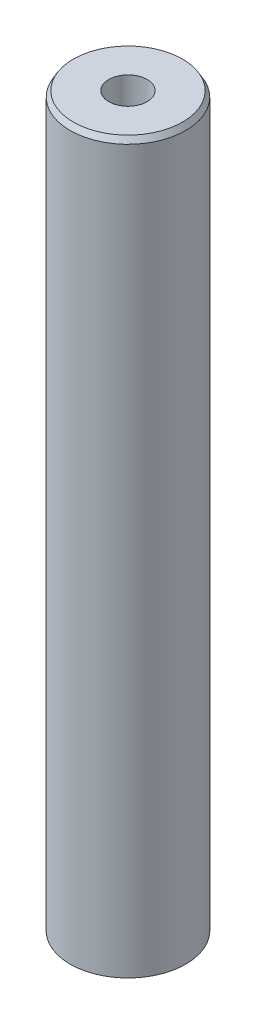
ISO-10303-21;
HEADER;
FILE_DESCRIPTION(('STEP AP214'),'2;1');
FILE_NAME('part.step','',(''),(''),'','','');
FILE_SCHEMA(('AUTOMOTIVE_DESIGN { 1 0 10303 214 1 1 1 1 }'));
ENDSEC;
DATA;
#1=APPLICATION_CONTEXT('core data for automotive mechanical design processes');
#2=APPLICATION_PROTOCOL_DEFINITION('international standard','automotive_design',2000,#1);
#3=PRODUCT_CONTEXT('',#1,'mechanical');
#4=PRODUCT('Part','Part','',(#3));
#5=PRODUCT_RELATED_PRODUCT_CATEGORY('part','',(#4));
#6=PRODUCT_DEFINITION_FORMATION('','',#4);
#7=PRODUCT_DEFINITION_CONTEXT('part definition',#1,'design');
#8=PRODUCT_DEFINITION('design','',#6,#7);
#9=PRODUCT_DEFINITION_SHAPE('','',#8);
#10=(LENGTH_UNIT() NAMED_UNIT(*) SI_UNIT(.MILLI.,.METRE.));
#11=(NAMED_UNIT(*) PLANE_ANGLE_UNIT() SI_UNIT($,.RADIAN.));
#12=(NAMED_UNIT(*) SI_UNIT($,.STERADIAN.) SOLID_ANGLE_UNIT());
#13=UNCERTAINTY_MEASURE_WITH_UNIT(LENGTH_MEASURE(1.E-05),#10,'distance_accuracy_value','');
#14=(GEOMETRIC_REPRESENTATION_CONTEXT(3) GLOBAL_UNCERTAINTY_ASSIGNED_CONTEXT((#13)) GLOBAL_UNIT_ASSIGNED_CONTEXT((#10,
#11,#12)) REPRESENTATION_CONTEXT('',''));
#15=CARTESIAN_POINT('',(0.,0.,0.));
#16=DIRECTION('',(0.,0.,1.));
#17=DIRECTION('',(1.,0.,0.));
#18=AXIS2_PLACEMENT_3D('',#15,#16,#17);
#19=CARTESIAN_POINT('',(0.,600.,0.));
#20=DIRECTION('',(0.,-1.,0.));
#21=DIRECTION('',(0.,0.,-1.));
#22=AXIS2_PLACEMENT_3D('',#19,#20,#21);
#23=CYLINDRICAL_SURFACE('',#22,47.5);
#24=CARTESIAN_POINT('',(0.,595.366315954171,0.));
#25=DIRECTION('',(0.,1.,0.));
#26=DIRECTION('',(0.,0.,1.));
#27=AXIS2_PLACEMENT_3D('',#24,#25,#26);
#28=CIRCLE('',#27,47.5);
#29=CARTESIAN_POINT('',(0.,595.366315954171,47.5));
#30=VERTEX_POINT('',#29);
#31=EDGE_CURVE('E50',#30,#30,#28,.F.);
#32=ORIENTED_EDGE('',*,*,#31,.T.);
#33=EDGE_LOOP('',(#32));
#34=FACE_BOUND('',#33,.T.);
#35=CARTESIAN_POINT('',(0.,2.67525873119911,0.));
#36=DIRECTION('',(0.,1.,0.));
#37=DIRECTION('',(0.,0.,1.));
#38=AXIS2_PLACEMENT_3D('',#35,#36,#37);
#39=CIRCLE('',#38,47.5);
#40=CARTESIAN_POINT('',(0.,2.67525873119911,47.5));
#41=VERTEX_POINT('',#40);
#42=EDGE_CURVE('E51',#41,#41,#39,.T.);
#43=ORIENTED_EDGE('',*,*,#42,.T.);
#44=EDGE_LOOP('',(#43));
#45=FACE_BOUND('',#44,.T.);
#46=ADVANCED_FACE('F39',(#34,#45),#23,.T.);
#47=CARTESIAN_POINT('',(0.,600.,0.));
#48=DIRECTION('',(0.,1.,0.));
#49=DIRECTION('',(0.,0.,1.));
#50=AXIS2_PLACEMENT_3D('',#47,#48,#49);
#51=PLANE('',#50);
#52=CARTESIAN_POINT('',(0.,600.,0.));
#53=DIRECTION('',(0.,1.,0.));
#54=DIRECTION('',(0.,0.,1.));
#55=AXIS2_PLACEMENT_3D('',#52,#53,#54);
#56=CIRCLE('',#55,44.8247412688009);
#57=CARTESIAN_POINT('',(0.,600.,44.8247412688009));
#58=VERTEX_POINT('',#57);
#59=EDGE_CURVE('E54',#58,#58,#56,.T.);
#60=ORIENTED_EDGE('',*,*,#59,.T.);
#61=EDGE_LOOP('',(#60));
#62=FACE_BOUND('',#61,.T.);
#63=CARTESIAN_POINT('',(0.,600.,0.));
#64=DIRECTION('',(0.,1.,0.));
#65=DIRECTION('',(0.,0.,1.));
#66=AXIS2_PLACEMENT_3D('',#63,#64,#65);
#67=CIRCLE('',#66,15.7942950828486);
#68=CARTESIAN_POINT('',(0.,600.,15.7942950828486));
#69=VERTEX_POINT('',#68);
#70=EDGE_CURVE('E58',#69,#69,#67,.T.);
#71=ORIENTED_EDGE('',*,*,#70,.F.);
#72=EDGE_LOOP('',(#71));
#73=FACE_BOUND('',#72,.T.);
#74=ADVANCED_FACE('F69',(#62,#73),#51,.T.);
#75=CARTESIAN_POINT('',(0.,0.,0.));
#76=DIRECTION('',(0.,1.,0.));
#77=DIRECTION('',(0.,0.,1.));
#78=AXIS2_PLACEMENT_3D('',#75,#76,#77);
#79=PLANE('',#78);
#80=CARTESIAN_POINT('',(0.,0.,0.));
#81=DIRECTION('',(0.,1.,0.));
#82=DIRECTION('',(0.,0.,1.));
#83=AXIS2_PLACEMENT_3D('',#80,#81,#82);
#84=CIRCLE('',#83,42.8663159541708);
#85=CARTESIAN_POINT('',(0.,0.,42.8663159541708));
#86=VERTEX_POINT('',#85);
#87=EDGE_CURVE('E10',#86,#86,#84,.F.);
#88=ORIENTED_EDGE('',*,*,#87,.T.);
#89=EDGE_LOOP('',(#88));
#90=FACE_BOUND('',#89,.T.);
#91=CARTESIAN_POINT('',(0.,0.,0.));
#92=DIRECTION('',(0.,1.,0.));
#93=DIRECTION('',(0.,0.,1.));
#94=AXIS2_PLACEMENT_3D('',#91,#92,#93);
#95=CIRCLE('',#94,15.7942950828486);
#96=CARTESIAN_POINT('',(0.,0.,15.7942950828486));
#97=VERTEX_POINT('',#96);
#98=EDGE_CURVE('E63',#97,#97,#95,.T.);
#99=ORIENTED_EDGE('',*,*,#98,.T.);
#100=EDGE_LOOP('',(#99));
#101=FACE_BOUND('',#100,.T.);
#102=ADVANCED_FACE('F75',(#90,#101),#79,.F.);
#103=CARTESIAN_POINT('',(0.,600.,0.));
#104=DIRECTION('',(0.,-1.,0.));
#105=DIRECTION('',(0.,0.,-1.));
#106=AXIS2_PLACEMENT_3D('',#103,#104,#105);
#107=CYLINDRICAL_SURFACE('',#106,15.7942950828486);
#108=ORIENTED_EDGE('',*,*,#70,.T.);
#109=EDGE_LOOP('',(#108));
#110=FACE_BOUND('',#109,.T.);
#111=ORIENTED_EDGE('',*,*,#98,.F.);
#112=EDGE_LOOP('',(#111));
#113=FACE_BOUND('',#112,.T.);
#114=ADVANCED_FACE('F70',(#110,#113),#107,.F.);
#115=CARTESIAN_POINT('',(0.,600.,0.));
#116=DIRECTION('',(0.,-1.,0.));
#117=DIRECTION('',(0.,0.,-1.));
#118=AXIS2_PLACEMENT_3D('',#115,#116,#117);
#119=CONICAL_SURFACE('',#118,44.8247412688009,0.523598775598294);
#120=ORIENTED_EDGE('',*,*,#31,.F.);
#121=EDGE_LOOP('',(#120));
#122=FACE_BOUND('',#121,.T.);
#123=ORIENTED_EDGE('',*,*,#59,.F.);
#124=EDGE_LOOP('',(#123));
#125=FACE_BOUND('',#124,.T.);
#126=ADVANCED_FACE('F81',(#122,#125),#119,.T.);
#127=CARTESIAN_POINT('',(0.,2.67525873119911,0.));
#128=DIRECTION('',(0.,1.,0.));
#129=DIRECTION('',(0.,0.,1.));
#130=AXIS2_PLACEMENT_3D('',#127,#128,#129);
#131=CONICAL_SURFACE('',#130,47.5,1.0471975511966);
#132=ORIENTED_EDGE('',*,*,#87,.F.);
#133=EDGE_LOOP('',(#132));
#134=FACE_BOUND('',#133,.T.);
#135=ORIENTED_EDGE('',*,*,#42,.F.);
#136=EDGE_LOOP('',(#135));
#137=FACE_BOUND('',#136,.T.);
#138=ADVANCED_FACE('F45',(#134,#137),#131,.T.);
#139=CLOSED_SHELL('',(#46,#74,#102,#114,#126,#138));
#140=MANIFOLD_SOLID_BREP('B2',#139);
#141=ADVANCED_BREP_SHAPE_REPRESENTATION('',(#18,#140),#14);
#142=SHAPE_DEFINITION_REPRESENTATION(#9,#141);
ENDSEC;
END-ISO-10303-21;
